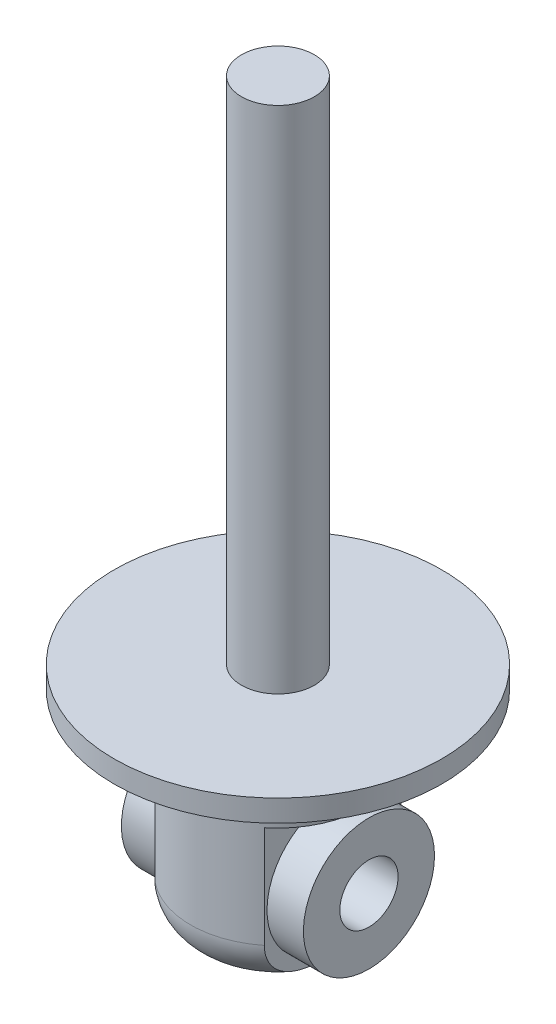
ISO-10303-21;
HEADER;
FILE_DESCRIPTION(('STEP AP214'),'2;1');
FILE_NAME('part.step','',(''),(''),'','','');
FILE_SCHEMA(('AUTOMOTIVE_DESIGN { 1 0 10303 214 1 1 1 1 }'));
ENDSEC;
DATA;
#1=APPLICATION_CONTEXT('core data for automotive mechanical design processes');
#2=APPLICATION_PROTOCOL_DEFINITION('international standard','automotive_design',2000,#1);
#3=PRODUCT_CONTEXT('',#1,'mechanical');
#4=PRODUCT('Part','Part','',(#3));
#5=PRODUCT_RELATED_PRODUCT_CATEGORY('part','',(#4));
#6=PRODUCT_DEFINITION_FORMATION('','',#4);
#7=PRODUCT_DEFINITION_CONTEXT('part definition',#1,'design');
#8=PRODUCT_DEFINITION('design','',#6,#7);
#9=PRODUCT_DEFINITION_SHAPE('','',#8);
#10=(LENGTH_UNIT() NAMED_UNIT(*) SI_UNIT(.MILLI.,.METRE.));
#11=(NAMED_UNIT(*) PLANE_ANGLE_UNIT() SI_UNIT($,.RADIAN.));
#12=(NAMED_UNIT(*) SI_UNIT($,.STERADIAN.) SOLID_ANGLE_UNIT());
#13=UNCERTAINTY_MEASURE_WITH_UNIT(LENGTH_MEASURE(1.E-05),#10,'distance_accuracy_value','');
#14=(GEOMETRIC_REPRESENTATION_CONTEXT(3) GLOBAL_UNCERTAINTY_ASSIGNED_CONTEXT((#13)) GLOBAL_UNIT_ASSIGNED_CONTEXT((#10,
#11,#12)) REPRESENTATION_CONTEXT('',''));
#15=CARTESIAN_POINT('',(0.,0.,0.));
#16=DIRECTION('',(0.,0.,1.));
#17=DIRECTION('',(1.,0.,0.));
#18=AXIS2_PLACEMENT_3D('',#15,#16,#17);
#19=CARTESIAN_POINT('',(7.5,-7.99999999999998,-22.5));
#20=DIRECTION('',(-1.,0.,0.));
#21=DIRECTION('',(0.,-1.,0.));
#22=AXIS2_PLACEMENT_3D('',#19,#20,#21);
#23=PLANE('',#22);
#24=CARTESIAN_POINT('',(7.5,-27.8094750193111,0.));
#25=CARTESIAN_POINT('',(7.5,-27.8094752958151,-0.18452162824242));
#26=CARTESIAN_POINT('',(7.5,-27.8077270322999,-0.369043480287192));
#27=CARTESIAN_POINT('',(7.5,-27.8006130628877,-0.737999394292286));
#28=CARTESIAN_POINT('',(7.5,-27.7952477367066,-0.922433463434386));
#29=CARTESIAN_POINT('',(7.5,-27.780538513706,-1.29122559425462));
#30=CARTESIAN_POINT('',(7.5,-27.7711929215574,-1.47558358999919));
#31=CARTESIAN_POINT('',(7.5,-27.7479507640883,-1.84401846668315));
#32=CARTESIAN_POINT('',(7.5,-27.734054140347,-2.0280953439834));
#33=CARTESIAN_POINT('',(7.5,-27.701027325669,-2.39498843631837));
#34=CARTESIAN_POINT('',(7.5,-27.6819201299087,-2.57780665418327));
#35=CARTESIAN_POINT('',(7.5,-27.6375682217561,-2.94269408038084));
#36=CARTESIAN_POINT('',(7.5,-27.6123230495969,-3.12476323156505));
#37=CARTESIAN_POINT('',(7.5,-27.5259360262262,-3.6691632505479));
#38=CARTESIAN_POINT('',(7.5,-27.4541196223952,-4.02997739530099));
#39=CARTESIAN_POINT('',(7.5,-27.315114172541,-4.57935988961709));
#40=CARTESIAN_POINT('',(7.5,-27.2608348848703,-4.7712225645297));
#41=CARTESIAN_POINT('',(7.5,-27.1402411036094,-5.15109529504943));
#42=CARTESIAN_POINT('',(7.5,-27.0739312594077,-5.3391068078654));
#43=CARTESIAN_POINT('',(7.5,-26.9281486989919,-5.70992505463464));
#44=CARTESIAN_POINT('',(7.5,-26.8486797977089,-5.8927332791208));
#45=CARTESIAN_POINT('',(7.5,-26.6756224712841,-6.25155879665884));
#46=CARTESIAN_POINT('',(7.5,-26.5820364486501,-6.4275772388346));
#47=CARTESIAN_POINT('',(7.5,-26.3958384208508,-6.74413785402998));
#48=CARTESIAN_POINT('',(7.5,-26.3053527427416,-6.8859302136676));
#49=CARTESIAN_POINT('',(7.5,-26.1136422044668,-7.16205254122039));
#50=CARTESIAN_POINT('',(7.5,-26.0124194056704,-7.29638393401337));
#51=CARTESIAN_POINT('',(7.5,-25.7991822855038,-7.55627452274062));
#52=CARTESIAN_POINT('',(7.5,-25.6871652583255,-7.6818315054992));
#53=CARTESIAN_POINT('',(7.5,-25.4525813942248,-7.92270374400352));
#54=CARTESIAN_POINT('',(7.5,-25.3300144777409,-8.03801892249803));
#55=CARTESIAN_POINT('',(7.5,-25.0736714823962,-8.25792234562975));
#56=CARTESIAN_POINT('',(7.5,-24.9398051473305,-8.36240569865935));
#57=CARTESIAN_POINT('',(7.5,-24.662616920615,-8.55796576900282));
#58=CARTESIAN_POINT('',(7.5,-24.5192963548439,-8.64904436046083));
#59=CARTESIAN_POINT('',(7.5,-24.2243409104845,-8.81636481076627));
#60=CARTESIAN_POINT('',(7.5,-24.0727112205184,-8.89261579636783));
#61=CARTESIAN_POINT('',(7.5,-23.7624095052739,-9.02909243430965));
#62=CARTESIAN_POINT('',(7.5,-23.6037388369551,-9.08932115899453));
#63=CARTESIAN_POINT('',(7.5,-23.3052245459151,-9.1849514334904));
#64=CARTESIAN_POINT('',(7.5,-23.166136129491,-9.22272405795733));
#65=CARTESIAN_POINT('',(7.5,-22.8851087613884,-9.28547940350164));
#66=CARTESIAN_POINT('',(7.5,-22.7431701638949,-9.31046370365637));
#67=CARTESIAN_POINT('',(7.5,-22.4576599589478,-9.34730641699015));
#68=CARTESIAN_POINT('',(7.5,-22.3140890586128,-9.35917031033292));
#69=CARTESIAN_POINT('',(7.5,-22.0264648581988,-9.36963164548865));
#70=CARTESIAN_POINT('',(7.5,-21.8824115750842,-9.36822954903947));
#71=CARTESIAN_POINT('',(7.5,-21.6061914815275,-9.35280339576898));
#72=CARTESIAN_POINT('',(7.5,-21.4739684759153,-9.33976569953801));
#73=CARTESIAN_POINT('',(7.5,-21.2110534946456,-9.3025636387872));
#74=CARTESIAN_POINT('',(7.5,-21.0803620180608,-9.27839574533065));
#75=CARTESIAN_POINT('',(7.5,-20.8215410609612,-9.21922065645586));
#76=CARTESIAN_POINT('',(7.5,-20.6934101253726,-9.1842198149556));
#77=CARTESIAN_POINT('',(7.5,-20.4404340442512,-9.1037455253616));
#78=CARTESIAN_POINT('',(7.5,-20.3155901493276,-9.05826815366643));
#79=CARTESIAN_POINT('',(7.5,-20.0692031015505,-8.95699564520569));
#80=CARTESIAN_POINT('',(7.5,-19.9476868658852,-8.90113499399755));
#81=CARTESIAN_POINT('',(7.5,-19.7094920695403,-8.77987692751896));
#82=CARTESIAN_POINT('',(7.5,-19.5928152563103,-8.71447610526942));
#83=CARTESIAN_POINT('',(7.5,-19.2509911073174,-8.50489875856371));
#84=CARTESIAN_POINT('',(7.5,-19.0339195251877,-8.34729299116934));
#85=CARTESIAN_POINT('',(7.5,-18.609337427954,-7.98870608163152));
#86=CARTESIAN_POINT('',(7.5,-18.4039002281567,-7.78529755950601));
#87=CARTESIAN_POINT('',(7.5,-18.0246758733926,-7.35109040646742));
#88=CARTESIAN_POINT('',(7.5,-17.8508837047537,-7.12029612399674));
#89=CARTESIAN_POINT('',(7.5,-17.5744409595824,-6.69864287979115));
#90=CARTESIAN_POINT('',(7.5,-17.4648689537028,-6.51223410047273));
#91=CARTESIAN_POINT('',(7.5,-17.2626904112623,-6.13034538679086));
#92=CARTESIAN_POINT('',(7.5,-17.1700919878543,-5.93486117014358));
#93=CARTESIAN_POINT('',(7.5,-17.0006313082269,-5.53658641063457));
#94=CARTESIAN_POINT('',(7.5,-16.9238147555949,-5.3337765932138));
#95=CARTESIAN_POINT('',(7.5,-16.784875362625,-4.9233142846081));
#96=CARTESIAN_POINT('',(7.5,-16.7227484430634,-4.71566315546474));
#97=CARTESIAN_POINT('',(7.5,-16.5386673542946,-4.02250667384635));
#98=CARTESIAN_POINT('',(7.5,-16.4449803111871,-3.52942656369881));
#99=CARTESIAN_POINT('',(7.5,-16.3412352530644,-2.78498720051466));
#100=CARTESIAN_POINT('',(7.5,-16.3127705467372,-2.53568557770049));
#101=CARTESIAN_POINT('',(7.5,-16.2658269581612,-2.03612434937438));
#102=CARTESIAN_POINT('',(7.5,-16.2473468655649,-1.78586486368141));
#103=CARTESIAN_POINT('',(7.5,-16.2184283009414,-1.28363112408652));
#104=CARTESIAN_POINT('',(7.5,-16.208031590786,-1.03165466176091));
#105=CARTESIAN_POINT('',(7.5,-16.1941849220444,-0.527501194688676));
#106=CARTESIAN_POINT('',(7.5,-16.1907352988047,-0.275324180848907));
#107=CARTESIAN_POINT('',(7.5,-16.1903333462322,0.22873134560298));
#108=CARTESIAN_POINT('',(7.5,-16.193373232494,0.480609853630178));
#109=CARTESIAN_POINT('',(7.5,-16.2063332691715,0.98417358149427));
#110=CARTESIAN_POINT('',(7.5,-16.2162528039696,1.23585881660874));
#111=CARTESIAN_POINT('',(7.5,-16.2454935008677,1.76278825668934));
#112=CARTESIAN_POINT('',(7.5,-16.2656211327378,2.03798990109172));
#113=CARTESIAN_POINT('',(7.5,-16.3180418431018,2.58731345976839));
#114=CARTESIAN_POINT('',(7.5,-16.3503365349836,2.86143522597444));
#115=CARTESIAN_POINT('',(7.5,-16.4300545548583,3.40623279358437));
#116=CARTESIAN_POINT('',(7.5,-16.4774071358833,3.67691867401874));
#117=CARTESIAN_POINT('',(7.5,-16.5907053400646,4.21439476079952));
#118=CARTESIAN_POINT('',(7.5,-16.6566449229111,4.4811862031647));
#119=CARTESIAN_POINT('',(7.5,-16.7911834026755,4.94217748017443));
#120=CARTESIAN_POINT('',(7.5,-16.8549558474619,5.13778160857807));
#121=CARTESIAN_POINT('',(7.5,-16.9961265709521,5.5239942274174));
#122=CARTESIAN_POINT('',(7.5,-17.073520789267,5.71460418712137));
#123=CARTESIAN_POINT('',(7.5,-17.2430793617625,6.0892198722189));
#124=CARTESIAN_POINT('',(7.5,-17.3352463319138,6.27322442084438));
#125=CARTESIAN_POINT('',(7.5,-17.5351759469553,6.63256976145457));
#126=CARTESIAN_POINT('',(7.5,-17.6429345063483,6.80791280693598));
#127=CARTESIAN_POINT('',(7.5,-17.8487615005737,7.10989658300674));
#128=CARTESIAN_POINT('',(7.5,-17.9436617626469,7.23870103997639));
#129=CARTESIAN_POINT('',(7.5,-18.143229826346,7.48856622066219));
#130=CARTESIAN_POINT('',(7.5,-18.2478987883735,7.60962602152205));
#131=CARTESIAN_POINT('',(7.5,-18.4668045949393,7.84271387792475));
#132=CARTESIAN_POINT('',(7.5,-18.5810384459287,7.95474473789613));
#133=CARTESIAN_POINT('',(7.5,-18.8187268203134,8.16854933672495));
#134=CARTESIAN_POINT('',(7.5,-18.9421800591116,8.27032449994957));
#135=CARTESIAN_POINT('',(7.5,-19.1987356397018,8.46313596223061));
#136=CARTESIAN_POINT('',(7.5,-19.3319055781875,8.55408255407203));
#137=CARTESIAN_POINT('',(7.5,-19.6061418402457,8.72304401015933));
#138=CARTESIAN_POINT('',(7.5,-19.747204378254,8.80106500403696));
#139=CARTESIAN_POINT('',(7.5,-20.0362068877473,8.94309470867638));
#140=CARTESIAN_POINT('',(7.5,-20.1841460034049,9.00710515749597));
#141=CARTESIAN_POINT('',(7.5,-20.4856380297523,9.12014361193692));
#142=CARTESIAN_POINT('',(7.5,-20.6391901444676,9.16917373274798));
#143=CARTESIAN_POINT('',(7.5,-20.9313639562727,9.24643392787081));
#144=CARTESIAN_POINT('',(7.5,-21.0695088202567,9.27647685632879));
#145=CARTESIAN_POINT('',(7.5,-21.3479315795213,9.32406143536891));
#146=CARTESIAN_POINT('',(7.5,-21.4882092809527,9.34160421520928));
#147=CARTESIAN_POINT('',(7.5,-21.769719609589,9.36396002322678));
#148=CARTESIAN_POINT('',(7.5,-21.9109518422674,9.36877802253041));
#149=CARTESIAN_POINT('',(7.5,-22.1932734390957,9.36563613906261));
#150=CARTESIAN_POINT('',(7.5,-22.3343628067459,9.35767657732182));
#151=CARTESIAN_POINT('',(7.5,-22.6064011749062,9.32998563551062));
#152=CARTESIAN_POINT('',(7.5,-22.7374295539783,9.31102660205278));
#153=CARTESIAN_POINT('',(7.5,-22.9974780227225,9.26218788836621));
#154=CARTESIAN_POINT('',(7.5,-23.1264974548056,9.23230470755187));
#155=CARTESIAN_POINT('',(7.5,-23.3815508516768,9.16196479385525));
#156=CARTESIAN_POINT('',(7.5,-23.5075862018083,9.12151307666088));
#157=CARTESIAN_POINT('',(7.5,-23.7559772755244,9.03044888037393));
#158=CARTESIAN_POINT('',(7.5,-23.8783315975104,8.97983258590813));
#159=CARTESIAN_POINT('',(7.5,-24.1205569584555,8.8680617574251));
#160=CARTESIAN_POINT('',(7.5,-24.2403549182387,8.8067487702029));
#161=CARTESIAN_POINT('',(7.5,-24.4747211723639,8.67480187441993));
#162=CARTESIAN_POINT('',(7.5,-24.5892875713423,8.60416462323317));
#163=CARTESIAN_POINT('',(7.5,-24.9242270275788,8.37928997825773));
#164=CARTESIAN_POINT('',(7.5,-25.13600210755,8.21201407264852));
#165=CARTESIAN_POINT('',(7.5,-25.5504485361803,7.832942739178));
#166=CARTESIAN_POINT('',(7.5,-25.7507010772538,7.61853228584699));
#167=CARTESIAN_POINT('',(7.5,-26.1185076671662,7.16337882817298));
#168=CARTESIAN_POINT('',(7.5,-26.2860513710234,6.92262753032979));
#169=CARTESIAN_POINT('',(7.5,-26.5545024709803,6.4788664395953));
#170=CARTESIAN_POINT('',(7.5,-26.6619013252763,6.279707295078));
#171=CARTESIAN_POINT('',(7.5,-26.858559219587,5.87254463104013));
#172=CARTESIAN_POINT('',(7.5,-26.9478095430477,5.66453691936401));
#173=CARTESIAN_POINT('',(7.5,-27.1096214973705,5.24180758530233));
#174=CARTESIAN_POINT('',(7.5,-27.1821555960046,5.02707553901331));
#175=CARTESIAN_POINT('',(7.5,-27.3121001369762,4.59305326757355));
#176=CARTESIAN_POINT('',(7.5,-27.3695048137837,4.37376133898656));
#177=CARTESIAN_POINT('',(7.5,-27.4981886749365,3.81417726059937));
#178=CARTESIAN_POINT('',(7.5,-27.5604951716191,3.47183296905169));
#179=CARTESIAN_POINT('',(7.5,-27.6609019684328,2.78359200614869));
#180=CARTESIAN_POINT('',(7.5,-27.6989863972919,2.43769315620305));
#181=CARTESIAN_POINT('',(7.5,-27.7425563308733,1.91723181279187));
#182=CARTESIAN_POINT('',(7.5,-27.7548291128016,1.74318957751326));
#183=CARTESIAN_POINT('',(7.5,-27.7753986995787,1.39487161182966));
#184=CARTESIAN_POINT('',(7.5,-27.7836956019396,1.22059588725637));
#185=CARTESIAN_POINT('',(7.5,-27.796777523185,0.871965392986035));
#186=CARTESIAN_POINT('',(7.5,-27.8015635129394,0.697610658492168));
#187=CARTESIAN_POINT('',(7.5,-27.8079121855994,0.348837350643893));
#188=CARTESIAN_POINT('',(7.5,-27.8094747579462,0.174418775305038));
#189=CARTESIAN_POINT('',(7.5,-27.8094750193111,0.));
#190=B_SPLINE_CURVE_WITH_KNOTS('',3,(#24,#25,#26,#27,#28,#29,#30,#31,#32,#33,#34,#35,#36,#37,
#38,#39,#40,#41,#42,#43,#44,#45,#46,#47,#48,#49,#50,#51,#52,#53,#54,#55,#56,#57,#58,#59,#60,#61,
#62,#63,#64,#65,#66,#67,#68,#69,#70,#71,#72,#73,#74,#75,#76,#77,#78,#79,#80,#81,#82,#83,#84,#85,
#86,#87,#88,#89,#90,#91,#92,#93,#94,#95,#96,#97,#98,#99,#100,#101,#102,#103,#104,#105,#106,#107,
#108,#109,#110,#111,#112,#113,#114,#115,#116,#117,#118,#119,#120,#121,#122,#123,#124,#125,#126,
#127,#128,#129,#130,#131,#132,#133,#134,#135,#136,#137,#138,#139,#140,#141,#142,#143,#144,#145,
#146,#147,#148,#149,#150,#151,#152,#153,#154,#155,#156,#157,#158,#159,#160,#161,#162,#163,#164,
#165,#166,#167,#168,#169,#170,#171,#172,#173,#174,#175,#176,#177,#178,#179,#180,#181,#182,#183,
#184,#185,#186,#187,#188,#189),.UNSPECIFIED.,.T.,.F.,(4,2,2,2,2,2,2,2,2,2,2,2,2,2,2,2,2,2,2,2,2,
2,2,2,2,2,2,2,2,2,2,2,2,2,2,2,2,2,2,2,2,2,2,2,2,2,2,2,2,2,2,2,2,2,2,2,2,2,2,2,2,2,2,2,2,2,2,2,2,
2,2,2,2,2,2,2,2,2,2,2,2,2,4),(0.,0.553556541747909,1.10705498067111,1.66078940935171,
2.21453094651203,2.7658672034967,3.31724477121585,4.41912680182767,5.01698525599298,
5.61461314908643,6.21206808675635,6.80942146164093,7.31357153503217,7.81762499361292,
8.32180513447662,8.82598907791494,9.33467160980089,9.84328295415677,10.3515802378956,
10.8597799828438,11.291588037567,11.7233427606026,12.1549170790764,12.5864763761707,
12.9845986570771,13.3828472534997,13.7808627038906,14.1790274594522,14.579795450788,
14.9807069160888,15.7821103743006,16.6461503316802,17.5100532757815,18.1578732554314,
18.8060020817716,19.4559821948789,20.1057815998326,21.6069748462106,22.3596793389022,
23.1122925673176,23.8687687149109,24.6252813779039,25.3808870860739,26.1364251884592,
26.9640249034878,27.7917343993232,28.6156111127982,29.4392203950451,30.0559954213971,
30.6725869093733,31.2892877047367,31.9058271963483,32.3853559200308,32.86494167852,
33.3443778968313,33.823747436381,34.3068464150843,34.7897156366603,35.2725249226045,
35.7552660053908,36.1788379642465,36.6023716529343,37.0257398573389,37.4490974249689,
37.8458122806135,38.2426543730445,38.639308470493,39.0361117351622,39.4393886143668,
39.8428104576491,40.6491243408277,41.5260051520067,42.4031628508039,43.0810551134699,
43.7592721958252,44.4385984678267,45.1181832448308,46.1608437011148,47.2041866484774,
47.7275747628343,48.2509500399341,48.7741805338585,49.2974289735857),.UNSPECIFIED.);
#191=CARTESIAN_POINT('',(7.5,-22.,9.3674969975976));
#192=VERTEX_POINT('',#191);
#193=CARTESIAN_POINT('',(7.5,-21.9999999999999,-9.36749699759765));
#194=VERTEX_POINT('',#193);
#195=EDGE_CURVE('E82',#192,#194,#190,.T.);
#196=ORIENTED_EDGE('',*,*,#195,.T.);
#197=DIRECTION('',(0.,1.,0.));
#198=VECTOR('',#197,1.);
#199=CARTESIAN_POINT('',(7.5,-28.,-9.3674969975976));
#200=LINE('',#199,#198);
#201=CARTESIAN_POINT('',(7.5,-7.99999999999999,-9.3674969975976));
#202=VERTEX_POINT('',#201);
#203=EDGE_CURVE('E78',#202,#194,#200,.F.);
#204=ORIENTED_EDGE('',*,*,#203,.F.);
#205=DIRECTION('',(0.,0.,1.));
#206=VECTOR('',#205,1.);
#207=CARTESIAN_POINT('',(7.5,-7.99999999999998,-22.5));
#208=LINE('',#207,#206);
#209=CARTESIAN_POINT('',(7.5,-7.99999999999999,9.3674969975976));
#210=VERTEX_POINT('',#209);
#211=EDGE_CURVE('E81',#202,#210,#208,.T.);
#212=ORIENTED_EDGE('',*,*,#211,.T.);
#213=DIRECTION('',(0.,1.,0.));
#214=VECTOR('',#213,1.);
#215=CARTESIAN_POINT('',(7.5,-28.,9.3674969975976));
#216=LINE('',#215,#214);
#217=EDGE_CURVE('E52',#192,#210,#216,.T.);
#218=ORIENTED_EDGE('',*,*,#217,.F.);
#219=EDGE_LOOP('',(#196,#204,#212,#218));
#220=FACE_BOUND('',#219,.T.);
#221=CARTESIAN_POINT('',(7.5,-18.,0.));
#222=DIRECTION('',(-1.,0.,0.));
#223=DIRECTION('',(0.,-1.,0.));
#224=AXIS2_PLACEMENT_3D('',#221,#222,#223);
#225=CIRCLE('',#224,9.);
#226=CARTESIAN_POINT('',(7.5,-27.,0.));
#227=VERTEX_POINT('',#226);
#228=EDGE_CURVE('E11',#227,#227,#225,.F.);
#229=ORIENTED_EDGE('',*,*,#228,.F.);
#230=EDGE_LOOP('',(#229));
#231=FACE_BOUND('',#230,.T.);
#232=ADVANCED_FACE('F35',(#220,#231),#23,.F.);
#233=CARTESIAN_POINT('',(-7.5,-7.99999999999999,-22.5));
#234=DIRECTION('',(1.,0.,0.));
#235=DIRECTION('',(0.,1.,0.));
#236=AXIS2_PLACEMENT_3D('',#233,#234,#235);
#237=PLANE('',#236);
#238=CARTESIAN_POINT('',(-7.5,-27.8094750193111,0.));
#239=CARTESIAN_POINT('',(-7.5,-27.8094752958151,0.184521628242419));
#240=CARTESIAN_POINT('',(-7.5,-27.8077270322999,0.369043480287191));
#241=CARTESIAN_POINT('',(-7.5,-27.8006130628877,0.737999394292284));
#242=CARTESIAN_POINT('',(-7.5,-27.7952477367066,0.922433463434384));
#243=CARTESIAN_POINT('',(-7.5,-27.780538513706,1.29122559425462));
#244=CARTESIAN_POINT('',(-7.5,-27.7711929215574,1.47558358999919));
#245=CARTESIAN_POINT('',(-7.5,-27.7479507640883,1.84401846668315));
#246=CARTESIAN_POINT('',(-7.5,-27.734054140347,2.02809534398339));
#247=CARTESIAN_POINT('',(-7.5,-27.701027325669,2.39498843631837));
#248=CARTESIAN_POINT('',(-7.5,-27.6819201299087,2.57780665418326));
#249=CARTESIAN_POINT('',(-7.5,-27.6375682217561,2.94269408038083));
#250=CARTESIAN_POINT('',(-7.5,-27.6123230495969,3.12476323156505));
#251=CARTESIAN_POINT('',(-7.5,-27.5259360262262,3.6691632505479));
#252=CARTESIAN_POINT('',(-7.5,-27.4541196223952,4.02997739530099));
#253=CARTESIAN_POINT('',(-7.5,-27.315114172541,4.57935988961709));
#254=CARTESIAN_POINT('',(-7.5,-27.2608348848703,4.77122256452969));
#255=CARTESIAN_POINT('',(-7.5,-27.1402411036094,5.15109529504942));
#256=CARTESIAN_POINT('',(-7.5,-27.0739312594077,5.33910680786539));
#257=CARTESIAN_POINT('',(-7.5,-26.928148698992,5.70992505463463));
#258=CARTESIAN_POINT('',(-7.5,-26.8486797977089,5.8927332791208));
#259=CARTESIAN_POINT('',(-7.5,-26.6756224712841,6.25155879665883));
#260=CARTESIAN_POINT('',(-7.5,-26.5820364486502,6.42757723883459));
#261=CARTESIAN_POINT('',(-7.5,-26.3958384208508,6.74413785402998));
#262=CARTESIAN_POINT('',(-7.5,-26.3053527427416,6.8859302136676));
#263=CARTESIAN_POINT('',(-7.5,-26.1136422044668,7.16205254122039));
#264=CARTESIAN_POINT('',(-7.5,-26.0124194056704,7.29638393401336));
#265=CARTESIAN_POINT('',(-7.5,-25.7991822855038,7.55627452274061));
#266=CARTESIAN_POINT('',(-7.5,-25.6871652583255,7.6818315054992));
#267=CARTESIAN_POINT('',(-7.5,-25.4525813942248,7.92270374400352));
#268=CARTESIAN_POINT('',(-7.5,-25.3300144777409,8.03801892249803));
#269=CARTESIAN_POINT('',(-7.5,-25.0736714823962,8.25792234562975));
#270=CARTESIAN_POINT('',(-7.5,-24.9398051473305,8.36240569865935));
#271=CARTESIAN_POINT('',(-7.5,-24.662616920615,8.55796576900282));
#272=CARTESIAN_POINT('',(-7.5,-24.5192963548439,8.64904436046083));
#273=CARTESIAN_POINT('',(-7.5,-24.2243409104845,8.81636481076627));
#274=CARTESIAN_POINT('',(-7.5,-24.0727112205184,8.89261579636784));
#275=CARTESIAN_POINT('',(-7.5,-23.7624095052739,9.02909243430965));
#276=CARTESIAN_POINT('',(-7.5,-23.6037388369551,9.08932115899454));
#277=CARTESIAN_POINT('',(-7.5,-23.3052245459151,9.1849514334904));
#278=CARTESIAN_POINT('',(-7.5,-23.1661361294911,9.22272405795734));
#279=CARTESIAN_POINT('',(-7.5,-22.8851087613884,9.28547940350164));
#280=CARTESIAN_POINT('',(-7.5,-22.7431701638949,9.31046370365637));
#281=CARTESIAN_POINT('',(-7.5,-22.4576599589478,9.34730641699016));
#282=CARTESIAN_POINT('',(-7.5,-22.3140890586128,9.35917031033292));
#283=CARTESIAN_POINT('',(-7.5,-22.0264648581988,9.36963164548865));
#284=CARTESIAN_POINT('',(-7.5,-21.8824115750842,9.36822954903948));
#285=CARTESIAN_POINT('',(-7.5,-21.6061914815275,9.35280339576898));
#286=CARTESIAN_POINT('',(-7.5,-21.4739684759154,9.33976569953801));
#287=CARTESIAN_POINT('',(-7.5,-21.2110534946456,9.30256363878721));
#288=CARTESIAN_POINT('',(-7.5,-21.0803620180608,9.27839574533066));
#289=CARTESIAN_POINT('',(-7.5,-20.8215410609612,9.21922065645586));
#290=CARTESIAN_POINT('',(-7.5,-20.6934101253726,9.18421981495561));
#291=CARTESIAN_POINT('',(-7.5,-20.4404340442512,9.10374552536161));
#292=CARTESIAN_POINT('',(-7.5,-20.3155901493276,9.05826815366643));
#293=CARTESIAN_POINT('',(-7.5,-20.0692031015505,8.9569956452057));
#294=CARTESIAN_POINT('',(-7.5,-19.9476868658852,8.90113499399756));
#295=CARTESIAN_POINT('',(-7.5,-19.7094920695403,8.77987692751897));
#296=CARTESIAN_POINT('',(-7.5,-19.5928152563103,8.71447610526943));
#297=CARTESIAN_POINT('',(-7.5,-19.2509911073174,8.50489875856372));
#298=CARTESIAN_POINT('',(-7.5,-19.0339195251877,8.34729299116935));
#299=CARTESIAN_POINT('',(-7.5,-18.609337427954,7.98870608163153));
#300=CARTESIAN_POINT('',(-7.5,-18.4039002281567,7.78529755950602));
#301=CARTESIAN_POINT('',(-7.5,-18.0246758733926,7.35109040646744));
#302=CARTESIAN_POINT('',(-7.5,-17.8508837047537,7.12029612399675));
#303=CARTESIAN_POINT('',(-7.5,-17.5744409595824,6.69864287979116));
#304=CARTESIAN_POINT('',(-7.5,-17.4648689537028,6.51223410047274));
#305=CARTESIAN_POINT('',(-7.5,-17.2626904112623,6.13034538679087));
#306=CARTESIAN_POINT('',(-7.5,-17.1700919878543,5.93486117014359));
#307=CARTESIAN_POINT('',(-7.5,-17.0006313082269,5.53658641063458));
#308=CARTESIAN_POINT('',(-7.5,-16.9238147555949,5.33377659321381));
#309=CARTESIAN_POINT('',(-7.5,-16.784875362625,4.92331428460811));
#310=CARTESIAN_POINT('',(-7.5,-16.7227484430634,4.71566315546475));
#311=CARTESIAN_POINT('',(-7.5,-16.5386673542946,4.02250667384637));
#312=CARTESIAN_POINT('',(-7.5,-16.4449803111871,3.52942656369883));
#313=CARTESIAN_POINT('',(-7.5,-16.3412352530644,2.78498720051468));
#314=CARTESIAN_POINT('',(-7.5,-16.3127705467372,2.53568557770052));
#315=CARTESIAN_POINT('',(-7.5,-16.2658269581612,2.03612434937441));
#316=CARTESIAN_POINT('',(-7.5,-16.2473468655649,1.78586486368144));
#317=CARTESIAN_POINT('',(-7.5,-16.2184283009414,1.28363112408655));
#318=CARTESIAN_POINT('',(-7.5,-16.208031590786,1.03165466176094));
#319=CARTESIAN_POINT('',(-7.5,-16.1941849220444,0.527501194688708));
#320=CARTESIAN_POINT('',(-7.5,-16.1907352988047,0.275324180848941));
#321=CARTESIAN_POINT('',(-7.5,-16.1903333462322,-0.228731345602944));
#322=CARTESIAN_POINT('',(-7.5,-16.193373232494,-0.480609853630142));
#323=CARTESIAN_POINT('',(-7.5,-16.2063332691715,-0.984173581494233));
#324=CARTESIAN_POINT('',(-7.5,-16.2162528039696,-1.2358588166087));
#325=CARTESIAN_POINT('',(-7.5,-16.2454935008677,-1.7627882566893));
#326=CARTESIAN_POINT('',(-7.5,-16.2656211327378,-2.03798990109168));
#327=CARTESIAN_POINT('',(-7.5,-16.3180418431017,-2.58731345976836));
#328=CARTESIAN_POINT('',(-7.5,-16.3503365349836,-2.86143522597441));
#329=CARTESIAN_POINT('',(-7.5,-16.4300545548583,-3.40623279358435));
#330=CARTESIAN_POINT('',(-7.5,-16.4774071358833,-3.67691867401872));
#331=CARTESIAN_POINT('',(-7.5,-16.5907053400646,-4.2143947607995));
#332=CARTESIAN_POINT('',(-7.5,-16.6566449229111,-4.48118620316469));
#333=CARTESIAN_POINT('',(-7.5,-16.7911834026755,-4.94217748017442));
#334=CARTESIAN_POINT('',(-7.5,-16.8549558474619,-5.13778160857807));
#335=CARTESIAN_POINT('',(-7.5,-16.9961265709521,-5.52399422741739));
#336=CARTESIAN_POINT('',(-7.5,-17.0735207892669,-5.71460418712136));
#337=CARTESIAN_POINT('',(-7.5,-17.2430793617625,-6.08921987221889));
#338=CARTESIAN_POINT('',(-7.5,-17.3352463319138,-6.27322442084438));
#339=CARTESIAN_POINT('',(-7.5,-17.5351759469553,-6.63256976145457));
#340=CARTESIAN_POINT('',(-7.5,-17.6429345063483,-6.80791280693597));
#341=CARTESIAN_POINT('',(-7.5,-17.8487615005736,-7.10989658300674));
#342=CARTESIAN_POINT('',(-7.5,-17.9436617626469,-7.23870103997639));
#343=CARTESIAN_POINT('',(-7.5,-18.143229826346,-7.48856622066219));
#344=CARTESIAN_POINT('',(-7.5,-18.2478987883735,-7.60962602152205));
#345=CARTESIAN_POINT('',(-7.5,-18.4668045949393,-7.84271387792474));
#346=CARTESIAN_POINT('',(-7.5,-18.5810384459287,-7.95474473789612));
#347=CARTESIAN_POINT('',(-7.5,-18.8187268203134,-8.16854933672494));
#348=CARTESIAN_POINT('',(-7.5,-18.9421800591116,-8.27032449994956));
#349=CARTESIAN_POINT('',(-7.5,-19.1987356397018,-8.46313596223061));
#350=CARTESIAN_POINT('',(-7.5,-19.3319055781875,-8.55408255407202));
#351=CARTESIAN_POINT('',(-7.5,-19.6061418402457,-8.72304401015933));
#352=CARTESIAN_POINT('',(-7.5,-19.747204378254,-8.80106500403696));
#353=CARTESIAN_POINT('',(-7.5,-20.0362068877473,-8.94309470867639));
#354=CARTESIAN_POINT('',(-7.5,-20.1841460034049,-9.00710515749598));
#355=CARTESIAN_POINT('',(-7.5,-20.4856380297523,-9.12014361193693));
#356=CARTESIAN_POINT('',(-7.5,-20.6391901444676,-9.16917373274798));
#357=CARTESIAN_POINT('',(-7.5,-20.9313639562727,-9.24643392787081));
#358=CARTESIAN_POINT('',(-7.5,-21.0695088202567,-9.27647685632879));
#359=CARTESIAN_POINT('',(-7.5,-21.3479315795213,-9.32406143536891));
#360=CARTESIAN_POINT('',(-7.5,-21.4882092809526,-9.34160421520928));
#361=CARTESIAN_POINT('',(-7.5,-21.769719609589,-9.36396002322679));
#362=CARTESIAN_POINT('',(-7.5,-21.9109518422674,-9.36877802253041));
#363=CARTESIAN_POINT('',(-7.5,-22.1932734390957,-9.36563613906261));
#364=CARTESIAN_POINT('',(-7.5,-22.3343628067459,-9.35767657732182));
#365=CARTESIAN_POINT('',(-7.5,-22.6064011749062,-9.32998563551063));
#366=CARTESIAN_POINT('',(-7.5,-22.7374295539783,-9.31102660205279));
#367=CARTESIAN_POINT('',(-7.5,-22.9974780227225,-9.26218788836622));
#368=CARTESIAN_POINT('',(-7.5,-23.1264974548056,-9.23230470755187));
#369=CARTESIAN_POINT('',(-7.5,-23.3815508516768,-9.16196479385525));
#370=CARTESIAN_POINT('',(-7.5,-23.5075862018083,-9.12151307666088));
#371=CARTESIAN_POINT('',(-7.5,-23.7559772755244,-9.03044888037393));
#372=CARTESIAN_POINT('',(-7.5,-23.8783315975104,-8.97983258590814));
#373=CARTESIAN_POINT('',(-7.5,-24.1205569584555,-8.8680617574251));
#374=CARTESIAN_POINT('',(-7.5,-24.2403549182387,-8.80674877020291));
#375=CARTESIAN_POINT('',(-7.5,-24.4747211723639,-8.67480187441993));
#376=CARTESIAN_POINT('',(-7.5,-24.5892875713423,-8.60416462323317));
#377=CARTESIAN_POINT('',(-7.49999999999999,-24.9242270275788,-8.37928997825773));
#378=CARTESIAN_POINT('',(-7.5,-25.13600210755,-8.21201407264852));
#379=CARTESIAN_POINT('',(-7.5,-25.5504485361803,-7.83294273917801));
#380=CARTESIAN_POINT('',(-7.5,-25.7507010772538,-7.618532285847));
#381=CARTESIAN_POINT('',(-7.5,-26.1185076671662,-7.16337882817299));
#382=CARTESIAN_POINT('',(-7.5,-26.2860513710234,-6.9226275303298));
#383=CARTESIAN_POINT('',(-7.5,-26.5545024709803,-6.4788664395953));
#384=CARTESIAN_POINT('',(-7.5,-26.6619013252763,-6.279707295078));
#385=CARTESIAN_POINT('',(-7.5,-26.858559219587,-5.87254463104013));
#386=CARTESIAN_POINT('',(-7.5,-26.9478095430477,-5.66453691936401));
#387=CARTESIAN_POINT('',(-7.5,-27.1096214973705,-5.24180758530233));
#388=CARTESIAN_POINT('',(-7.5,-27.1821555960046,-5.02707553901332));
#389=CARTESIAN_POINT('',(-7.5,-27.3121001369762,-4.59305326757356));
#390=CARTESIAN_POINT('',(-7.5,-27.3695048137837,-4.37376133898657));
#391=CARTESIAN_POINT('',(-7.5,-27.4981886749365,-3.81417726059937));
#392=CARTESIAN_POINT('',(-7.5,-27.5604951716191,-3.4718329690517));
#393=CARTESIAN_POINT('',(-7.5,-27.6609019684328,-2.7835920061487));
#394=CARTESIAN_POINT('',(-7.5,-27.6989863972919,-2.43769315620305));
#395=CARTESIAN_POINT('',(-7.5,-27.7425563308733,-1.91723181279188));
#396=CARTESIAN_POINT('',(-7.5,-27.7548291128016,-1.74318957751326));
#397=CARTESIAN_POINT('',(-7.5,-27.7753986995787,-1.39487161182967));
#398=CARTESIAN_POINT('',(-7.5,-27.7836956019396,-1.22059588725638));
#399=CARTESIAN_POINT('',(-7.5,-27.796777523185,-0.87196539298604));
#400=CARTESIAN_POINT('',(-7.5,-27.8015635129394,-0.697610658492171));
#401=CARTESIAN_POINT('',(-7.5,-27.8079121855994,-0.348837350643893));
#402=CARTESIAN_POINT('',(-7.5,-27.8094747579462,-0.174418775305038));
#403=CARTESIAN_POINT('',(-7.5,-27.8094750193111,0.));
#404=B_SPLINE_CURVE_WITH_KNOTS('',3,(#238,#239,#240,#241,#242,#243,#244,#245,#246,#247,#248,
#249,#250,#251,#252,#253,#254,#255,#256,#257,#258,#259,#260,#261,#262,#263,#264,#265,#266,#267,
#268,#269,#270,#271,#272,#273,#274,#275,#276,#277,#278,#279,#280,#281,#282,#283,#284,#285,#286,
#287,#288,#289,#290,#291,#292,#293,#294,#295,#296,#297,#298,#299,#300,#301,#302,#303,#304,#305,
#306,#307,#308,#309,#310,#311,#312,#313,#314,#315,#316,#317,#318,#319,#320,#321,#322,#323,#324,
#325,#326,#327,#328,#329,#330,#331,#332,#333,#334,#335,#336,#337,#338,#339,#340,#341,#342,#343,
#344,#345,#346,#347,#348,#349,#350,#351,#352,#353,#354,#355,#356,#357,#358,#359,#360,#361,#362,
#363,#364,#365,#366,#367,#368,#369,#370,#371,#372,#373,#374,#375,#376,#377,#378,#379,#380,#381,
#382,#383,#384,#385,#386,#387,#388,#389,#390,#391,#392,#393,#394,#395,#396,#397,#398,#399,#400,
#401,#402,#403),.UNSPECIFIED.,.T.,.F.,(4,2,2,2,2,2,2,2,2,2,2,2,2,2,2,2,2,2,2,2,2,2,2,2,2,2,2,2,
2,2,2,2,2,2,2,2,2,2,2,2,2,2,2,2,2,2,2,2,2,2,2,2,2,2,2,2,2,2,2,2,2,2,2,2,2,2,2,2,2,2,2,2,2,2,2,2,
2,2,2,2,2,2,4),(0.,0.553556541747908,1.10705498067111,1.6607894093517,2.21453094651203,
2.76586720349669,3.31724477121585,4.41912680182767,5.01698525599297,5.61461314908642,
6.21206808675634,6.80942146164093,7.31357153503217,7.81762499361292,8.32180513447662,
8.82598907791493,9.33467160980089,9.84328295415677,10.3515802378956,10.8597799828438,
11.291588037567,11.7233427606026,12.1549170790764,12.5864763761706,12.9845986570771,
13.3828472534997,13.7808627038906,14.1790274594522,14.579795450788,14.9807069160888,
15.7821103743006,16.6461503316802,17.5100532757815,18.1578732554314,18.8060020817716,
19.4559821948789,20.1057815998326,21.6069748462105,22.3596793389022,23.1122925673176,
23.8687687149109,24.6252813779039,25.3808870860738,26.1364251884592,26.9640249034878,
27.7917343993232,28.6156111127982,29.4392203950451,30.0559954213971,30.6725869093733,
31.2892877047367,31.9058271963483,32.3853559200308,32.8649416785199,33.3443778968313,
33.823747436381,34.3068464150843,34.7897156366604,35.2725249226046,35.7552660053908,
36.1788379642465,36.6023716529343,37.0257398573389,37.4490974249689,37.8458122806135,
38.2426543730445,38.639308470493,39.0361117351622,39.4393886143668,39.8428104576492,
40.6491243408277,41.5260051520067,42.403162850804,43.0810551134699,43.7592721958252,
44.4385984678267,45.1181832448308,46.1608437011148,47.2041866484774,47.7275747628343,
48.2509500399341,48.7741805338585,49.2974289735857),.UNSPECIFIED.);
#405=CARTESIAN_POINT('',(-7.5,-22.,-9.3674969975976));
#406=VERTEX_POINT('',#405);
#407=CARTESIAN_POINT('',(-7.5,-21.9999999999999,9.36749699759766));
#408=VERTEX_POINT('',#407);
#409=EDGE_CURVE('E98',#406,#408,#404,.T.);
#410=ORIENTED_EDGE('',*,*,#409,.T.);
#411=DIRECTION('',(0.,1.,0.));
#412=VECTOR('',#411,1.);
#413=CARTESIAN_POINT('',(-7.49999999999999,-28.,9.3674969975976));
#414=LINE('',#413,#412);
#415=CARTESIAN_POINT('',(-7.5,-7.99999999999999,9.36749699759759));
#416=VERTEX_POINT('',#415);
#417=EDGE_CURVE('E177',#416,#408,#414,.F.);
#418=ORIENTED_EDGE('',*,*,#417,.F.);
#419=DIRECTION('',(0.,0.,1.));
#420=VECTOR('',#419,1.);
#421=CARTESIAN_POINT('',(-7.5,-7.99999999999999,-22.5));
#422=LINE('',#421,#420);
#423=CARTESIAN_POINT('',(-7.5,-7.99999999999999,-9.36749699759761));
#424=VERTEX_POINT('',#423);
#425=EDGE_CURVE('E87',#424,#416,#422,.T.);
#426=ORIENTED_EDGE('',*,*,#425,.F.);
#427=DIRECTION('',(0.,1.,0.));
#428=VECTOR('',#427,1.);
#429=CARTESIAN_POINT('',(-7.49999999999999,-28.,-9.3674969975976));
#430=LINE('',#429,#428);
#431=EDGE_CURVE('E60',#406,#424,#430,.T.);
#432=ORIENTED_EDGE('',*,*,#431,.F.);
#433=EDGE_LOOP('',(#410,#418,#426,#432));
#434=FACE_BOUND('',#433,.T.);
#435=CARTESIAN_POINT('',(-7.5,-18.,0.));
#436=DIRECTION('',(1.,0.,0.));
#437=DIRECTION('',(0.,1.,0.));
#438=AXIS2_PLACEMENT_3D('',#435,#436,#437);
#439=CIRCLE('',#438,9.);
#440=CARTESIAN_POINT('',(-7.5,-9.,0.));
#441=VERTEX_POINT('',#440);
#442=EDGE_CURVE('E40',#441,#441,#439,.F.);
#443=ORIENTED_EDGE('',*,*,#442,.F.);
#444=EDGE_LOOP('',(#443));
#445=FACE_BOUND('',#444,.T.);
#446=ADVANCED_FACE('F112',(#434,#445),#237,.F.);
#447=CARTESIAN_POINT('',(0.,3.,0.));
#448=DIRECTION('',(0.,-1.,0.));
#449=DIRECTION('',(0.,0.,-1.));
#450=AXIS2_PLACEMENT_3D('',#447,#448,#449);
#451=CYLINDRICAL_SURFACE('',#450,22.5);
#452=CARTESIAN_POINT('',(0.,3.,0.));
#453=DIRECTION('',(0.,1.,0.));
#454=DIRECTION('',(0.,0.,1.));
#455=AXIS2_PLACEMENT_3D('',#452,#453,#454);
#456=CIRCLE('',#455,22.5);
#457=CARTESIAN_POINT('',(0.,3.,22.5));
#458=VERTEX_POINT('',#457);
#459=EDGE_CURVE('E157',#458,#458,#456,.T.);
#460=ORIENTED_EDGE('',*,*,#459,.F.);
#461=EDGE_LOOP('',(#460));
#462=FACE_BOUND('',#461,.T.);
#463=CARTESIAN_POINT('',(0.,0.,0.));
#464=DIRECTION('',(0.,1.,0.));
#465=DIRECTION('',(0.,0.,1.));
#466=AXIS2_PLACEMENT_3D('',#463,#464,#465);
#467=CIRCLE('',#466,22.5);
#468=CARTESIAN_POINT('',(0.,0.,22.5));
#469=VERTEX_POINT('',#468);
#470=EDGE_CURVE('E160',#469,#469,#467,.T.);
#471=ORIENTED_EDGE('',*,*,#470,.T.);
#472=EDGE_LOOP('',(#471));
#473=FACE_BOUND('',#472,.T.);
#474=ADVANCED_FACE('F117',(#462,#473),#451,.T.);
#475=CARTESIAN_POINT('',(0.,3.,0.));
#476=DIRECTION('',(0.,1.,0.));
#477=DIRECTION('',(0.,0.,1.));
#478=AXIS2_PLACEMENT_3D('',#475,#476,#477);
#479=PLANE('',#478);
#480=CARTESIAN_POINT('',(0.,3.,0.));
#481=DIRECTION('',(0.,1.,0.));
#482=DIRECTION('',(0.,0.,1.));
#483=AXIS2_PLACEMENT_3D('',#480,#481,#482);
#484=CIRCLE('',#483,5.);
#485=CARTESIAN_POINT('',(0.,3.,5.));
#486=VERTEX_POINT('',#485);
#487=EDGE_CURVE('E164',#486,#486,#484,.T.);
#488=ORIENTED_EDGE('',*,*,#487,.F.);
#489=EDGE_LOOP('',(#488));
#490=FACE_BOUND('',#489,.T.);
#491=ORIENTED_EDGE('',*,*,#459,.T.);
#492=EDGE_LOOP('',(#491));
#493=FACE_BOUND('',#492,.T.);
#494=ADVANCED_FACE('F144',(#490,#493),#479,.T.);
#495=CARTESIAN_POINT('',(0.,0.,0.));
#496=DIRECTION('',(0.,1.,0.));
#497=DIRECTION('',(0.,0.,1.));
#498=AXIS2_PLACEMENT_3D('',#495,#496,#497);
#499=PLANE('',#498);
#500=CARTESIAN_POINT('',(0.,0.,0.));
#501=DIRECTION('',(0.,-1.,0.));
#502=DIRECTION('',(0.,0.,-1.));
#503=AXIS2_PLACEMENT_3D('',#500,#501,#502);
#504=CIRCLE('',#503,12.);
#505=CARTESIAN_POINT('',(0.,0.,-12.));
#506=VERTEX_POINT('',#505);
#507=EDGE_CURVE('E173',#506,#506,#504,.T.);
#508=ORIENTED_EDGE('',*,*,#507,.F.);
#509=EDGE_LOOP('',(#508));
#510=FACE_BOUND('',#509,.T.);
#511=ORIENTED_EDGE('',*,*,#470,.F.);
#512=EDGE_LOOP('',(#511));
#513=FACE_BOUND('',#512,.T.);
#514=ADVANCED_FACE('F142',(#510,#513),#499,.F.);
#515=CARTESIAN_POINT('',(0.,73.,0.));
#516=DIRECTION('',(0.,-1.,0.));
#517=DIRECTION('',(0.,0.,-1.));
#518=AXIS2_PLACEMENT_3D('',#515,#516,#517);
#519=CYLINDRICAL_SURFACE('',#518,5.);
#520=CARTESIAN_POINT('',(0.,73.,0.));
#521=DIRECTION('',(0.,1.,0.));
#522=DIRECTION('',(0.,0.,1.));
#523=AXIS2_PLACEMENT_3D('',#520,#521,#522);
#524=CIRCLE('',#523,5.);
#525=CARTESIAN_POINT('',(0.,73.,5.));
#526=VERTEX_POINT('',#525);
#527=EDGE_CURVE('E162',#526,#526,#524,.T.);
#528=ORIENTED_EDGE('',*,*,#527,.F.);
#529=EDGE_LOOP('',(#528));
#530=FACE_BOUND('',#529,.T.);
#531=ORIENTED_EDGE('',*,*,#487,.T.);
#532=EDGE_LOOP('',(#531));
#533=FACE_BOUND('',#532,.T.);
#534=ADVANCED_FACE('F138',(#530,#533),#519,.T.);
#535=CARTESIAN_POINT('',(0.,73.,0.));
#536=DIRECTION('',(0.,1.,0.));
#537=DIRECTION('',(0.,0.,1.));
#538=AXIS2_PLACEMENT_3D('',#535,#536,#537);
#539=PLANE('',#538);
#540=ORIENTED_EDGE('',*,*,#527,.T.);
#541=EDGE_LOOP('',(#540));
#542=FACE_BOUND('',#541,.T.);
#543=ADVANCED_FACE('F135',(#542),#539,.T.);
#544=CARTESIAN_POINT('',(0.,-28.,0.));
#545=DIRECTION('',(0.,1.,0.));
#546=DIRECTION('',(0.,0.,1.));
#547=AXIS2_PLACEMENT_3D('',#544,#545,#546);
#548=CYLINDRICAL_SURFACE('',#547,12.);
#549=CARTESIAN_POINT('',(0.,-22.,0.));
#550=DIRECTION('',(0.,-1.,0.));
#551=DIRECTION('',(0.,0.,-1.));
#552=AXIS2_PLACEMENT_3D('',#549,#550,#551);
#553=CIRCLE('',#552,12.);
#554=EDGE_CURVE('E172',#194,#406,#553,.F.);
#555=ORIENTED_EDGE('',*,*,#554,.T.);
#556=ORIENTED_EDGE('',*,*,#431,.T.);
#557=CARTESIAN_POINT('',(0.,-7.99999999999999,0.));
#558=DIRECTION('',(0.,1.,0.));
#559=DIRECTION('',(-1.,0.,0.));
#560=AXIS2_PLACEMENT_3D('',#557,#558,#559);
#561=CIRCLE('',#560,12.);
#562=EDGE_CURVE('E97',#424,#416,#561,.T.);
#563=ORIENTED_EDGE('',*,*,#562,.T.);
#564=ORIENTED_EDGE('',*,*,#417,.T.);
#565=EDGE_CURVE('E174',#408,#192,#553,.F.);
#566=ORIENTED_EDGE('',*,*,#565,.T.);
#567=ORIENTED_EDGE('',*,*,#217,.T.);
#568=CARTESIAN_POINT('',(0.,-7.99999999999999,0.));
#569=DIRECTION('',(0.,1.,0.));
#570=DIRECTION('',(-1.,0.,0.));
#571=AXIS2_PLACEMENT_3D('',#568,#569,#570);
#572=CIRCLE('',#571,12.);
#573=EDGE_CURVE('E91',#210,#202,#572,.T.);
#574=ORIENTED_EDGE('',*,*,#573,.T.);
#575=ORIENTED_EDGE('',*,*,#203,.T.);
#576=EDGE_LOOP('',(#555,#556,#563,#564,#566,#567,#574,#575));
#577=FACE_BOUND('',#576,.T.);
#578=ORIENTED_EDGE('',*,*,#507,.T.);
#579=EDGE_LOOP('',(#578));
#580=FACE_BOUND('',#579,.T.);
#581=ADVANCED_FACE('F94',(#577,#580),#548,.T.);
#582=CARTESIAN_POINT('',(0.,-28.,0.));
#583=DIRECTION('',(0.,-1.,0.));
#584=DIRECTION('',(0.,0.,-1.));
#585=AXIS2_PLACEMENT_3D('',#582,#583,#584);
#586=PLANE('',#585);
#587=CARTESIAN_POINT('',(0.,-28.,0.));
#588=DIRECTION('',(0.,-1.,0.));
#589=DIRECTION('',(0.,0.,-1.));
#590=AXIS2_PLACEMENT_3D('',#587,#588,#589);
#591=CIRCLE('',#590,6.);
#592=CARTESIAN_POINT('',(0.,-28.,-6.));
#593=VERTEX_POINT('',#592);
#594=EDGE_CURVE('E170',#593,#593,#591,.T.);
#595=ORIENTED_EDGE('',*,*,#594,.T.);
#596=EDGE_LOOP('',(#595));
#597=FACE_BOUND('',#596,.T.);
#598=ADVANCED_FACE('F129',(#597),#586,.T.);
#599=CARTESIAN_POINT('',(0.,-22.,0.));
#600=DIRECTION('',(0.,-1.,0.));
#601=DIRECTION('',(0.,0.,-1.));
#602=AXIS2_PLACEMENT_3D('',#599,#600,#601);
#603=TOROIDAL_SURFACE('',#602,6.,6.);
#604=ORIENTED_EDGE('',*,*,#409,.F.);
#605=ORIENTED_EDGE('',*,*,#554,.F.);
#606=ORIENTED_EDGE('',*,*,#195,.F.);
#607=ORIENTED_EDGE('',*,*,#565,.F.);
#608=EDGE_LOOP('',(#604,#605,#606,#607));
#609=FACE_BOUND('',#608,.T.);
#610=ORIENTED_EDGE('',*,*,#594,.F.);
#611=EDGE_LOOP('',(#610));
#612=FACE_BOUND('',#611,.T.);
#613=ADVANCED_FACE('F37',(#609,#612),#603,.T.);
#614=CARTESIAN_POINT('',(27.4834262312244,-7.99999999999998,-22.5));
#615=DIRECTION('',(0.,1.,0.));
#616=DIRECTION('',(-1.,0.,0.));
#617=AXIS2_PLACEMENT_3D('',#614,#615,#616);
#618=PLANE('',#617);
#619=ORIENTED_EDGE('',*,*,#211,.F.);
#620=ORIENTED_EDGE('',*,*,#573,.F.);
#621=EDGE_LOOP('',(#619,#620));
#622=FACE_BOUND('',#621,.T.);
#623=ADVANCED_FACE('F90',(#622),#618,.F.);
#624=CARTESIAN_POINT('',(-27.4834262312244,-7.99999999999999,-22.5));
#625=DIRECTION('',(0.,1.,0.));
#626=DIRECTION('',(-1.,0.,0.));
#627=AXIS2_PLACEMENT_3D('',#624,#625,#626);
#628=PLANE('',#627);
#629=ORIENTED_EDGE('',*,*,#425,.T.);
#630=ORIENTED_EDGE('',*,*,#562,.F.);
#631=EDGE_LOOP('',(#629,#630));
#632=FACE_BOUND('',#631,.T.);
#633=ADVANCED_FACE('F120',(#632),#628,.F.);
#634=CARTESIAN_POINT('',(12.5,-18.,0.));
#635=DIRECTION('',(-1.,0.,0.));
#636=DIRECTION('',(0.,0.,1.));
#637=AXIS2_PLACEMENT_3D('',#634,#635,#636);
#638=CYLINDRICAL_SURFACE('',#637,9.);
#639=CARTESIAN_POINT('',(-12.5,-18.,0.));
#640=DIRECTION('',(1.,0.,0.));
#641=DIRECTION('',(0.,0.,-1.));
#642=AXIS2_PLACEMENT_3D('',#639,#640,#641);
#643=CIRCLE('',#642,9.);
#644=CARTESIAN_POINT('',(-12.5,-18.,-9.));
#645=VERTEX_POINT('',#644);
#646=EDGE_CURVE('E194',#645,#645,#643,.T.);
#647=ORIENTED_EDGE('',*,*,#646,.T.);
#648=EDGE_LOOP('',(#647));
#649=FACE_BOUND('',#648,.T.);
#650=ORIENTED_EDGE('',*,*,#442,.T.);
#651=EDGE_LOOP('',(#650));
#652=FACE_BOUND('',#651,.T.);
#653=ADVANCED_FACE('F122',(#649,#652),#638,.T.);
#654=CARTESIAN_POINT('',(-12.5,-18.,0.));
#655=DIRECTION('',(1.,0.,0.));
#656=DIRECTION('',(0.,0.,-1.));
#657=AXIS2_PLACEMENT_3D('',#654,#655,#656);
#658=PLANE('',#657);
#659=ORIENTED_EDGE('',*,*,#646,.F.);
#660=EDGE_LOOP('',(#659));
#661=FACE_BOUND('',#660,.T.);
#662=CARTESIAN_POINT('',(-12.5,-18.,0.));
#663=DIRECTION('',(1.,0.,0.));
#664=DIRECTION('',(0.,0.,-1.));
#665=AXIS2_PLACEMENT_3D('',#662,#663,#664);
#666=CIRCLE('',#665,4.);
#667=CARTESIAN_POINT('',(-12.5,-18.,-4.));
#668=VERTEX_POINT('',#667);
#669=EDGE_CURVE('E200',#668,#668,#666,.T.);
#670=ORIENTED_EDGE('',*,*,#669,.T.);
#671=EDGE_LOOP('',(#670));
#672=FACE_BOUND('',#671,.T.);
#673=ADVANCED_FACE('F217',(#661,#672),#658,.F.);
#674=CARTESIAN_POINT('',(-22.5,-18.,0.));
#675=DIRECTION('',(1.,0.,0.));
#676=DIRECTION('',(0.,1.,0.));
#677=AXIS2_PLACEMENT_3D('',#674,#675,#676);
#678=CYLINDRICAL_SURFACE('',#677,4.);
#679=ORIENTED_EDGE('',*,*,#669,.F.);
#680=EDGE_LOOP('',(#679));
#681=FACE_BOUND('',#680,.T.);
#682=CARTESIAN_POINT('',(12.5,-18.,0.));
#683=DIRECTION('',(1.,0.,0.));
#684=DIRECTION('',(0.,0.,-1.));
#685=AXIS2_PLACEMENT_3D('',#682,#683,#684);
#686=CIRCLE('',#685,4.);
#687=CARTESIAN_POINT('',(12.5,-18.,-4.));
#688=VERTEX_POINT('',#687);
#689=EDGE_CURVE('E197',#688,#688,#686,.T.);
#690=ORIENTED_EDGE('',*,*,#689,.T.);
#691=EDGE_LOOP('',(#690));
#692=FACE_BOUND('',#691,.T.);
#693=ADVANCED_FACE('F118',(#681,#692),#678,.F.);
#694=CARTESIAN_POINT('',(12.5,-18.,0.));
#695=DIRECTION('',(1.,0.,0.));
#696=DIRECTION('',(0.,0.,-1.));
#697=AXIS2_PLACEMENT_3D('',#694,#695,#696);
#698=CIRCLE('',#697,9.);
#699=CARTESIAN_POINT('',(12.5,-18.,-9.));
#700=VERTEX_POINT('',#699);
#701=EDGE_CURVE('E92',#700,#700,#698,.T.);
#702=ORIENTED_EDGE('',*,*,#701,.F.);
#703=EDGE_LOOP('',(#702));
#704=FACE_BOUND('',#703,.T.);
#705=ORIENTED_EDGE('',*,*,#228,.T.);
#706=EDGE_LOOP('',(#705));
#707=FACE_BOUND('',#706,.T.);
#708=ADVANCED_FACE('F209',(#704,#707),#638,.T.);
#709=CARTESIAN_POINT('',(12.5,-18.,0.));
#710=DIRECTION('',(1.,0.,0.));
#711=DIRECTION('',(0.,0.,-1.));
#712=AXIS2_PLACEMENT_3D('',#709,#710,#711);
#713=PLANE('',#712);
#714=ORIENTED_EDGE('',*,*,#701,.T.);
#715=EDGE_LOOP('',(#714));
#716=FACE_BOUND('',#715,.T.);
#717=ORIENTED_EDGE('',*,*,#689,.F.);
#718=EDGE_LOOP('',(#717));
#719=FACE_BOUND('',#718,.T.);
#720=ADVANCED_FACE('F207',(#716,#719),#713,.T.);
#721=CLOSED_SHELL('',(#232,#446,#474,#494,#514,#534,#543,#581,#598,#613,#623,#633,#653,#673,
#693,#708,#720));
#722=MANIFOLD_SOLID_BREP('B2',#721);
#723=ADVANCED_BREP_SHAPE_REPRESENTATION('',(#18,#722),#14);
#724=SHAPE_DEFINITION_REPRESENTATION(#9,#723);
ENDSEC;
END-ISO-10303-21;
